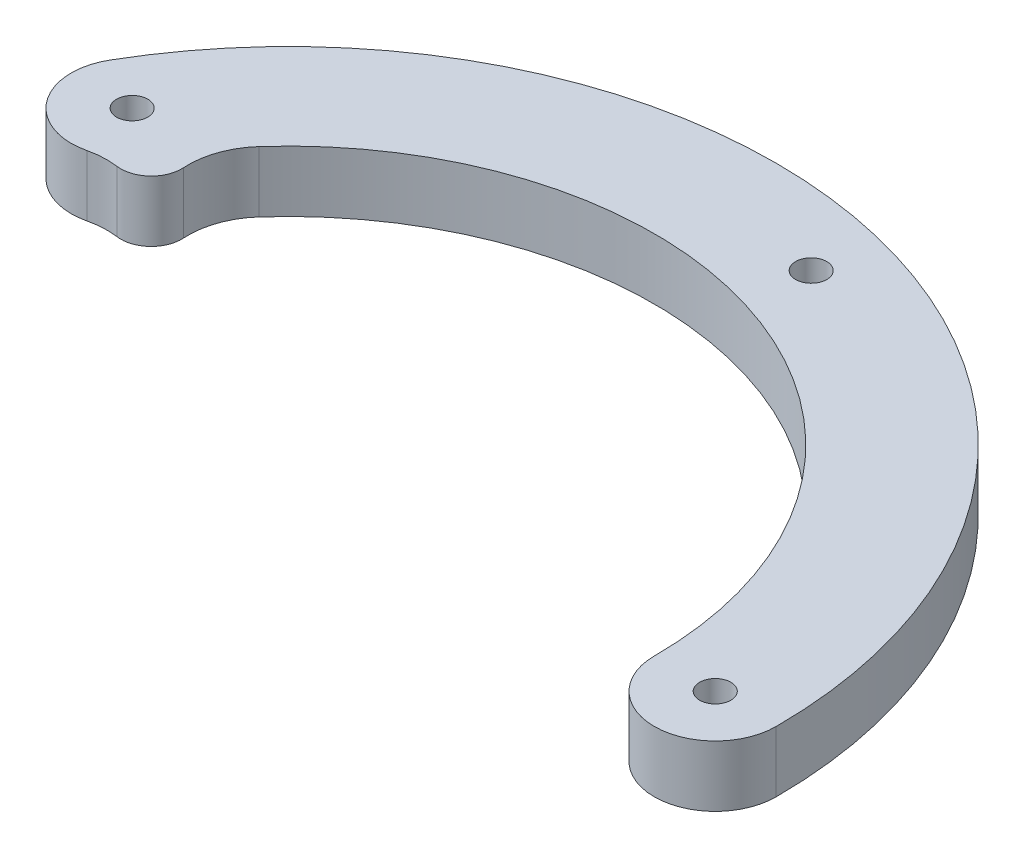
ISO-10303-21;
HEADER;
FILE_DESCRIPTION(('STEP AP214'),'2;1');
FILE_NAME('part.step','',(''),(''),'','','');
FILE_SCHEMA(('AUTOMOTIVE_DESIGN { 1 0 10303 214 1 1 1 1 }'));
ENDSEC;
DATA;
#1=APPLICATION_CONTEXT('core data for automotive mechanical design processes');
#2=APPLICATION_PROTOCOL_DEFINITION('international standard','automotive_design',2000,#1);
#3=PRODUCT_CONTEXT('',#1,'mechanical');
#4=PRODUCT('Part','Part','',(#3));
#5=PRODUCT_RELATED_PRODUCT_CATEGORY('part','',(#4));
#6=PRODUCT_DEFINITION_FORMATION('','',#4);
#7=PRODUCT_DEFINITION_CONTEXT('part definition',#1,'design');
#8=PRODUCT_DEFINITION('design','',#6,#7);
#9=PRODUCT_DEFINITION_SHAPE('','',#8);
#10=(LENGTH_UNIT() NAMED_UNIT(*) SI_UNIT(.MILLI.,.METRE.));
#11=(NAMED_UNIT(*) PLANE_ANGLE_UNIT() SI_UNIT($,.RADIAN.));
#12=(NAMED_UNIT(*) SI_UNIT($,.STERADIAN.) SOLID_ANGLE_UNIT());
#13=UNCERTAINTY_MEASURE_WITH_UNIT(LENGTH_MEASURE(1.E-05),#10,'distance_accuracy_value','');
#14=(GEOMETRIC_REPRESENTATION_CONTEXT(3) GLOBAL_UNCERTAINTY_ASSIGNED_CONTEXT((#13)) GLOBAL_UNIT_ASSIGNED_CONTEXT((#10,
#11,#12)) REPRESENTATION_CONTEXT('',''));
#15=CARTESIAN_POINT('',(0.,0.,0.));
#16=DIRECTION('',(0.,0.,1.));
#17=DIRECTION('',(1.,0.,0.));
#18=AXIS2_PLACEMENT_3D('',#15,#16,#17);
#19=CARTESIAN_POINT('',(22.225,6.35,0.));
#20=DIRECTION('',(0.,1.,0.));
#21=DIRECTION('',(0.,0.,1.));
#22=AXIS2_PLACEMENT_3D('',#19,#20,#21);
#23=PLANE('',#22);
#24=CARTESIAN_POINT('',(44.45,6.35,0.));
#25=DIRECTION('',(0.,1.,0.));
#26=DIRECTION('',(0.,0.,1.));
#27=AXIS2_PLACEMENT_3D('',#24,#25,#26);
#28=CIRCLE('',#27,1.625);
#29=CARTESIAN_POINT('',(44.45,6.35,1.625));
#30=VERTEX_POINT('',#29);
#31=EDGE_CURVE('E192',#30,#30,#28,.T.);
#32=ORIENTED_EDGE('',*,*,#31,.F.);
#33=EDGE_LOOP('',(#32));
#34=FACE_BOUND('',#33,.T.);
#35=CARTESIAN_POINT('',(44.45,6.35,0.));
#36=DIRECTION('',(0.,1.,0.));
#37=DIRECTION('',(0.,0.,1.));
#38=AXIS2_PLACEMENT_3D('',#35,#36,#37);
#39=CIRCLE('',#38,6.35);
#40=CARTESIAN_POINT('',(38.1,6.35,0.));
#41=VERTEX_POINT('',#40);
#42=CARTESIAN_POINT('',(50.8,6.35,0.));
#43=VERTEX_POINT('',#42);
#44=EDGE_CURVE('E155',#41,#43,#39,.T.);
#45=ORIENTED_EDGE('',*,*,#44,.T.);
#46=CARTESIAN_POINT('',(0.,6.35,0.));
#47=DIRECTION('',(0.,1.,0.));
#48=DIRECTION('',(0.,0.,1.));
#49=AXIS2_PLACEMENT_3D('',#46,#47,#48);
#50=CIRCLE('',#49,50.8);
#51=CARTESIAN_POINT('',(-43.9940905122496,6.35,-25.3999999999997));
#52=VERTEX_POINT('',#51);
#53=EDGE_CURVE('E97',#43,#52,#50,.T.);
#54=ORIENTED_EDGE('',*,*,#53,.T.);
#55=CARTESIAN_POINT('',(-38.4948291982184,6.35,-22.2249999999998));
#56=DIRECTION('',(0.,1.,0.));
#57=DIRECTION('',(0.,0.,1.));
#58=AXIS2_PLACEMENT_3D('',#55,#56,#57);
#59=CIRCLE('',#58,6.35);
#60=CARTESIAN_POINT('',(-37.0197224431111,6.35,-16.0487098464337));
#61=VERTEX_POINT('',#60);
#62=EDGE_CURVE('E172',#52,#61,#59,.T.);
#63=ORIENTED_EDGE('',*,*,#62,.T.);
#64=CARTESIAN_POINT('',(-35.1613202319519,6.35,-8.26755689705927));
#65=DIRECTION('',(0.,-1.,0.));
#66=DIRECTION('',(0.,0.,-1.));
#67=AXIS2_PLACEMENT_3D('',#64,#65,#66);
#68=CIRCLE('',#67,8.00000000000001);
#69=CARTESIAN_POINT('',(-34.0591449247505,6.35,-16.1912687540235));
#70=VERTEX_POINT('',#69);
#71=EDGE_CURVE('E113',#61,#70,#68,.T.);
#72=ORIENTED_EDGE('',*,*,#71,.T.);
#73=CARTESIAN_POINT('',(-33.6217190997049,6.35,-19.3359918972562));
#74=DIRECTION('',(0.,1.,0.));
#75=DIRECTION('',(0.,0.,1.));
#76=AXIS2_PLACEMENT_3D('',#73,#74,#75);
#77=CIRCLE('',#76,3.175);
#78=CARTESIAN_POINT('',(-30.4528416116572,6.35,-19.5330717433698));
#79=VERTEX_POINT('',#78);
#80=EDGE_CURVE('E107',#70,#79,#77,.T.);
#81=ORIENTED_EDGE('',*,*,#80,.T.);
#82=CARTESIAN_POINT('',(-22.4682684134266,6.35,-20.0296508831836));
#83=DIRECTION('',(0.,-1.,0.));
#84=DIRECTION('',(0.,0.,-1.));
#85=AXIS2_PLACEMENT_3D('',#82,#83,#84);
#86=CIRCLE('',#85,8.);
#87=CARTESIAN_POINT('',(-28.4399012143373,6.35,-25.3531461345281));
#88=VERTEX_POINT('',#87);
#89=EDGE_CURVE('E111',#79,#88,#86,.T.);
#90=ORIENTED_EDGE('',*,*,#89,.T.);
#91=CARTESIAN_POINT('',(0.,6.35,0.));
#92=DIRECTION('',(0.,-1.,0.));
#93=DIRECTION('',(0.,0.,1.));
#94=AXIS2_PLACEMENT_3D('',#91,#92,#93);
#95=CIRCLE('',#94,38.1);
#96=EDGE_CURVE('E57',#88,#41,#95,.T.);
#97=ORIENTED_EDGE('',*,*,#96,.T.);
#98=EDGE_LOOP('',(#45,#54,#63,#72,#81,#90,#97));
#99=FACE_BOUND('',#98,.T.);
#100=CARTESIAN_POINT('',(-38.4948291982184,6.35,-22.2249999999998));
#101=DIRECTION('',(0.,1.,0.));
#102=DIRECTION('',(0.,0.,1.));
#103=AXIS2_PLACEMENT_3D('',#100,#101,#102);
#104=CIRCLE('',#103,1.625);
#105=CARTESIAN_POINT('',(-38.4948291982184,6.35,-20.5999999999998));
#106=VERTEX_POINT('',#105);
#107=EDGE_CURVE('E140',#106,#106,#104,.T.);
#108=ORIENTED_EDGE('',*,*,#107,.F.);
#109=EDGE_LOOP('',(#108));
#110=FACE_BOUND('',#109,.T.);
#111=CARTESIAN_POINT('',(11.5045065548069,6.35,-42.9354029785491));
#112=DIRECTION('',(0.,1.,0.));
#113=DIRECTION('',(0.,0.,1.));
#114=AXIS2_PLACEMENT_3D('',#111,#112,#113);
#115=CIRCLE('',#114,1.625);
#116=CARTESIAN_POINT('',(11.5045065548069,6.35,-41.3104029785491));
#117=VERTEX_POINT('',#116);
#118=EDGE_CURVE('E200',#117,#117,#115,.T.);
#119=ORIENTED_EDGE('',*,*,#118,.F.);
#120=EDGE_LOOP('',(#119));
#121=FACE_BOUND('',#120,.T.);
#122=ADVANCED_FACE('F39',(#34,#99,#110,#121),#23,.T.);
#123=CARTESIAN_POINT('',(22.225,0.,0.));
#124=DIRECTION('',(0.,1.,0.));
#125=DIRECTION('',(0.,0.,1.));
#126=AXIS2_PLACEMENT_3D('',#123,#124,#125);
#127=PLANE('',#126);
#128=CARTESIAN_POINT('',(44.45,0.,0.));
#129=DIRECTION('',(0.,1.,0.));
#130=DIRECTION('',(0.,0.,1.));
#131=AXIS2_PLACEMENT_3D('',#128,#129,#130);
#132=CIRCLE('',#131,6.35);
#133=CARTESIAN_POINT('',(38.1,0.,0.));
#134=VERTEX_POINT('',#133);
#135=CARTESIAN_POINT('',(50.8,0.,0.));
#136=VERTEX_POINT('',#135);
#137=EDGE_CURVE('E135',#134,#136,#132,.T.);
#138=ORIENTED_EDGE('',*,*,#137,.F.);
#139=CARTESIAN_POINT('',(0.,0.,0.));
#140=DIRECTION('',(0.,-1.,0.));
#141=DIRECTION('',(0.,0.,1.));
#142=AXIS2_PLACEMENT_3D('',#139,#140,#141);
#143=CIRCLE('',#142,38.1);
#144=CARTESIAN_POINT('',(-28.4399012143373,0.,-25.3531461345281));
#145=VERTEX_POINT('',#144);
#146=EDGE_CURVE('E89',#145,#134,#143,.T.);
#147=ORIENTED_EDGE('',*,*,#146,.F.);
#148=CARTESIAN_POINT('',(-22.4682684134266,0.,-20.0296508831836));
#149=DIRECTION('',(0.,-1.,0.));
#150=DIRECTION('',(0.,0.,-1.));
#151=AXIS2_PLACEMENT_3D('',#148,#149,#150);
#152=CIRCLE('',#151,8.);
#153=CARTESIAN_POINT('',(-30.4528416116572,0.,-19.5330717433698));
#154=VERTEX_POINT('',#153);
#155=EDGE_CURVE('E83',#154,#145,#152,.T.);
#156=ORIENTED_EDGE('',*,*,#155,.F.);
#157=CARTESIAN_POINT('',(-33.6217190997049,0.,-19.3359918972562));
#158=DIRECTION('',(0.,1.,0.));
#159=DIRECTION('',(0.,0.,1.));
#160=AXIS2_PLACEMENT_3D('',#157,#158,#159);
#161=CIRCLE('',#160,3.175);
#162=CARTESIAN_POINT('',(-34.0591449247505,0.,-16.1912687540235));
#163=VERTEX_POINT('',#162);
#164=EDGE_CURVE('E122',#163,#154,#161,.T.);
#165=ORIENTED_EDGE('',*,*,#164,.F.);
#166=CARTESIAN_POINT('',(-35.1613202319519,0.,-8.26755689705927));
#167=DIRECTION('',(0.,-1.,0.));
#168=DIRECTION('',(0.,0.,-1.));
#169=AXIS2_PLACEMENT_3D('',#166,#167,#168);
#170=CIRCLE('',#169,8.00000000000001);
#171=CARTESIAN_POINT('',(-37.0197224431111,0.,-16.0487098464337));
#172=VERTEX_POINT('',#171);
#173=EDGE_CURVE('E146',#172,#163,#170,.T.);
#174=ORIENTED_EDGE('',*,*,#173,.F.);
#175=CARTESIAN_POINT('',(-38.4948291982184,0.,-22.2249999999998));
#176=DIRECTION('',(0.,1.,0.));
#177=DIRECTION('',(0.,0.,1.));
#178=AXIS2_PLACEMENT_3D('',#175,#176,#177);
#179=CIRCLE('',#178,6.35);
#180=CARTESIAN_POINT('',(-43.9940905122496,0.,-25.3999999999997));
#181=VERTEX_POINT('',#180);
#182=EDGE_CURVE('E143',#181,#172,#179,.T.);
#183=ORIENTED_EDGE('',*,*,#182,.F.);
#184=CARTESIAN_POINT('',(0.,0.,0.));
#185=DIRECTION('',(0.,1.,0.));
#186=DIRECTION('',(0.,0.,1.));
#187=AXIS2_PLACEMENT_3D('',#184,#185,#186);
#188=CIRCLE('',#187,50.8);
#189=EDGE_CURVE('E139',#136,#181,#188,.T.);
#190=ORIENTED_EDGE('',*,*,#189,.F.);
#191=EDGE_LOOP('',(#138,#147,#156,#165,#174,#183,#190));
#192=FACE_BOUND('',#191,.T.);
#193=CARTESIAN_POINT('',(-38.4948291982184,0.,-22.2249999999998));
#194=DIRECTION('',(0.,1.,0.));
#195=DIRECTION('',(0.,0.,1.));
#196=AXIS2_PLACEMENT_3D('',#193,#194,#195);
#197=CIRCLE('',#196,1.625);
#198=CARTESIAN_POINT('',(-38.4948291982184,0.,-20.5999999999998));
#199=VERTEX_POINT('',#198);
#200=EDGE_CURVE('E188',#199,#199,#197,.T.);
#201=ORIENTED_EDGE('',*,*,#200,.T.);
#202=EDGE_LOOP('',(#201));
#203=FACE_BOUND('',#202,.T.);
#204=CARTESIAN_POINT('',(44.45,0.,0.));
#205=DIRECTION('',(0.,1.,0.));
#206=DIRECTION('',(0.,0.,1.));
#207=AXIS2_PLACEMENT_3D('',#204,#205,#206);
#208=CIRCLE('',#207,1.625);
#209=CARTESIAN_POINT('',(44.45,0.,1.625));
#210=VERTEX_POINT('',#209);
#211=EDGE_CURVE('E196',#210,#210,#208,.T.);
#212=ORIENTED_EDGE('',*,*,#211,.T.);
#213=EDGE_LOOP('',(#212));
#214=FACE_BOUND('',#213,.T.);
#215=CARTESIAN_POINT('',(11.5045065548069,0.,-42.9354029785491));
#216=DIRECTION('',(0.,1.,0.));
#217=DIRECTION('',(0.,0.,1.));
#218=AXIS2_PLACEMENT_3D('',#215,#216,#217);
#219=CIRCLE('',#218,1.625);
#220=CARTESIAN_POINT('',(11.5045065548069,0.,-41.3104029785491));
#221=VERTEX_POINT('',#220);
#222=EDGE_CURVE('E204',#221,#221,#219,.T.);
#223=ORIENTED_EDGE('',*,*,#222,.T.);
#224=EDGE_LOOP('',(#223));
#225=FACE_BOUND('',#224,.T.);
#226=ADVANCED_FACE('F176',(#192,#203,#214,#225),#127,.F.);
#227=CARTESIAN_POINT('',(44.45,6.35,0.));
#228=DIRECTION('',(0.,-1.,0.));
#229=DIRECTION('',(0.,0.,-1.));
#230=AXIS2_PLACEMENT_3D('',#227,#228,#229);
#231=CYLINDRICAL_SURFACE('',#230,6.35);
#232=ORIENTED_EDGE('',*,*,#137,.T.);
#233=DIRECTION('',(0.,-1.,0.));
#234=VECTOR('',#233,1.);
#235=CARTESIAN_POINT('',(50.8,6.35,0.));
#236=LINE('',#235,#234);
#237=EDGE_CURVE('E11',#43,#136,#236,.T.);
#238=ORIENTED_EDGE('',*,*,#237,.F.);
#239=ORIENTED_EDGE('',*,*,#44,.F.);
#240=DIRECTION('',(0.,-1.,0.));
#241=VECTOR('',#240,1.);
#242=CARTESIAN_POINT('',(38.1,6.35,0.));
#243=LINE('',#242,#241);
#244=EDGE_CURVE('E131',#41,#134,#243,.T.);
#245=ORIENTED_EDGE('',*,*,#244,.T.);
#246=EDGE_LOOP('',(#232,#238,#239,#245));
#247=FACE_BOUND('',#246,.T.);
#248=ADVANCED_FACE('F41',(#247),#231,.T.);
#249=CARTESIAN_POINT('',(0.,6.35,0.));
#250=DIRECTION('',(0.,-1.,0.));
#251=DIRECTION('',(0.,0.,-1.));
#252=AXIS2_PLACEMENT_3D('',#249,#250,#251);
#253=CYLINDRICAL_SURFACE('',#252,50.8);
#254=ORIENTED_EDGE('',*,*,#189,.T.);
#255=DIRECTION('',(0.,-1.,0.));
#256=VECTOR('',#255,1.);
#257=CARTESIAN_POINT('',(-43.9940905122496,6.35,-25.3999999999997));
#258=LINE('',#257,#256);
#259=EDGE_CURVE('E49',#52,#181,#258,.T.);
#260=ORIENTED_EDGE('',*,*,#259,.F.);
#261=ORIENTED_EDGE('',*,*,#53,.F.);
#262=ORIENTED_EDGE('',*,*,#237,.T.);
#263=EDGE_LOOP('',(#254,#260,#261,#262));
#264=FACE_BOUND('',#263,.T.);
#265=ADVANCED_FACE('F237',(#264),#253,.T.);
#266=CARTESIAN_POINT('',(-38.4948291982184,6.35,-22.2249999999998));
#267=DIRECTION('',(0.,-1.,0.));
#268=DIRECTION('',(0.,0.,-1.));
#269=AXIS2_PLACEMENT_3D('',#266,#267,#268);
#270=CYLINDRICAL_SURFACE('',#269,6.35);
#271=ORIENTED_EDGE('',*,*,#182,.T.);
#272=DIRECTION('',(0.,-1.,0.));
#273=VECTOR('',#272,1.);
#274=CARTESIAN_POINT('',(-37.0197224431111,6.35,-16.0487098464337));
#275=LINE('',#274,#273);
#276=EDGE_CURVE('E162',#61,#172,#275,.T.);
#277=ORIENTED_EDGE('',*,*,#276,.F.);
#278=ORIENTED_EDGE('',*,*,#62,.F.);
#279=ORIENTED_EDGE('',*,*,#259,.T.);
#280=EDGE_LOOP('',(#271,#277,#278,#279));
#281=FACE_BOUND('',#280,.T.);
#282=ADVANCED_FACE('F170',(#281),#270,.T.);
#283=CARTESIAN_POINT('',(-35.1613202319519,6.35,-8.26755689705927));
#284=DIRECTION('',(0.,-1.,0.));
#285=DIRECTION('',(0.,0.,-1.));
#286=AXIS2_PLACEMENT_3D('',#283,#284,#285);
#287=CYLINDRICAL_SURFACE('',#286,8.00000000000001);
#288=ORIENTED_EDGE('',*,*,#173,.T.);
#289=DIRECTION('',(0.,-1.,0.));
#290=VECTOR('',#289,1.);
#291=CARTESIAN_POINT('',(-34.0591449247505,6.35,-16.1912687540235));
#292=LINE('',#291,#290);
#293=EDGE_CURVE('E124',#70,#163,#292,.T.);
#294=ORIENTED_EDGE('',*,*,#293,.F.);
#295=ORIENTED_EDGE('',*,*,#71,.F.);
#296=ORIENTED_EDGE('',*,*,#276,.T.);
#297=EDGE_LOOP('',(#288,#294,#295,#296));
#298=FACE_BOUND('',#297,.T.);
#299=ADVANCED_FACE('F179',(#298),#287,.F.);
#300=CARTESIAN_POINT('',(-33.6217190997049,6.35,-19.3359918972562));
#301=DIRECTION('',(0.,-1.,0.));
#302=DIRECTION('',(0.,0.,-1.));
#303=AXIS2_PLACEMENT_3D('',#300,#301,#302);
#304=CYLINDRICAL_SURFACE('',#303,3.175);
#305=ORIENTED_EDGE('',*,*,#164,.T.);
#306=DIRECTION('',(0.,-1.,0.));
#307=VECTOR('',#306,1.);
#308=CARTESIAN_POINT('',(-30.4528416116572,6.35,-19.5330717433698));
#309=LINE('',#308,#307);
#310=EDGE_CURVE('E119',#79,#154,#309,.T.);
#311=ORIENTED_EDGE('',*,*,#310,.F.);
#312=ORIENTED_EDGE('',*,*,#80,.F.);
#313=ORIENTED_EDGE('',*,*,#293,.T.);
#314=EDGE_LOOP('',(#305,#311,#312,#313));
#315=FACE_BOUND('',#314,.T.);
#316=ADVANCED_FACE('F120',(#315),#304,.T.);
#317=CARTESIAN_POINT('',(-22.4682684134266,6.35,-20.0296508831836));
#318=DIRECTION('',(0.,-1.,0.));
#319=DIRECTION('',(0.,0.,-1.));
#320=AXIS2_PLACEMENT_3D('',#317,#318,#319);
#321=CYLINDRICAL_SURFACE('',#320,8.);
#322=ORIENTED_EDGE('',*,*,#155,.T.);
#323=DIRECTION('',(0.,-1.,0.));
#324=VECTOR('',#323,1.);
#325=CARTESIAN_POINT('',(-28.4399012143373,6.35,-25.3531461345281));
#326=LINE('',#325,#324);
#327=EDGE_CURVE('E125',#88,#145,#326,.T.);
#328=ORIENTED_EDGE('',*,*,#327,.F.);
#329=ORIENTED_EDGE('',*,*,#89,.F.);
#330=ORIENTED_EDGE('',*,*,#310,.T.);
#331=EDGE_LOOP('',(#322,#328,#329,#330));
#332=FACE_BOUND('',#331,.T.);
#333=ADVANCED_FACE('F127',(#332),#321,.F.);
#334=CARTESIAN_POINT('',(0.,6.35,0.));
#335=DIRECTION('',(0.,-1.,0.));
#336=DIRECTION('',(0.,0.,-1.));
#337=AXIS2_PLACEMENT_3D('',#334,#335,#336);
#338=CYLINDRICAL_SURFACE('',#337,38.1);
#339=ORIENTED_EDGE('',*,*,#146,.T.);
#340=ORIENTED_EDGE('',*,*,#244,.F.);
#341=ORIENTED_EDGE('',*,*,#96,.F.);
#342=ORIENTED_EDGE('',*,*,#327,.T.);
#343=EDGE_LOOP('',(#339,#340,#341,#342));
#344=FACE_BOUND('',#343,.T.);
#345=ADVANCED_FACE('F227',(#344),#338,.F.);
#346=CARTESIAN_POINT('',(-38.4948291982184,6.35,-22.2249999999998));
#347=DIRECTION('',(0.,-1.,0.));
#348=DIRECTION('',(0.,0.,-1.));
#349=AXIS2_PLACEMENT_3D('',#346,#347,#348);
#350=CYLINDRICAL_SURFACE('',#349,1.625);
#351=ORIENTED_EDGE('',*,*,#107,.T.);
#352=EDGE_LOOP('',(#351));
#353=FACE_BOUND('',#352,.T.);
#354=ORIENTED_EDGE('',*,*,#200,.F.);
#355=EDGE_LOOP('',(#354));
#356=FACE_BOUND('',#355,.T.);
#357=ADVANCED_FACE('F224',(#353,#356),#350,.F.);
#358=CARTESIAN_POINT('',(44.45,6.35,0.));
#359=DIRECTION('',(0.,-1.,0.));
#360=DIRECTION('',(0.,0.,-1.));
#361=AXIS2_PLACEMENT_3D('',#358,#359,#360);
#362=CYLINDRICAL_SURFACE('',#361,1.625);
#363=ORIENTED_EDGE('',*,*,#31,.T.);
#364=EDGE_LOOP('',(#363));
#365=FACE_BOUND('',#364,.T.);
#366=ORIENTED_EDGE('',*,*,#211,.F.);
#367=EDGE_LOOP('',(#366));
#368=FACE_BOUND('',#367,.T.);
#369=ADVANCED_FACE('F296',(#365,#368),#362,.F.);
#370=CARTESIAN_POINT('',(11.5045065548069,6.35,-42.9354029785491));
#371=DIRECTION('',(0.,-1.,0.));
#372=DIRECTION('',(0.,0.,-1.));
#373=AXIS2_PLACEMENT_3D('',#370,#371,#372);
#374=CYLINDRICAL_SURFACE('',#373,1.625);
#375=ORIENTED_EDGE('',*,*,#118,.T.);
#376=EDGE_LOOP('',(#375));
#377=FACE_BOUND('',#376,.T.);
#378=ORIENTED_EDGE('',*,*,#222,.F.);
#379=EDGE_LOOP('',(#378));
#380=FACE_BOUND('',#379,.T.);
#381=ADVANCED_FACE('F212',(#377,#380),#374,.F.);
#382=CLOSED_SHELL('',(#122,#226,#248,#265,#282,#299,#316,#333,#345,#357,#369,#381));
#383=MANIFOLD_SOLID_BREP('B2',#382);
#384=ADVANCED_BREP_SHAPE_REPRESENTATION('',(#18,#383),#14);
#385=SHAPE_DEFINITION_REPRESENTATION(#9,#384);
ENDSEC;
END-ISO-10303-21;
